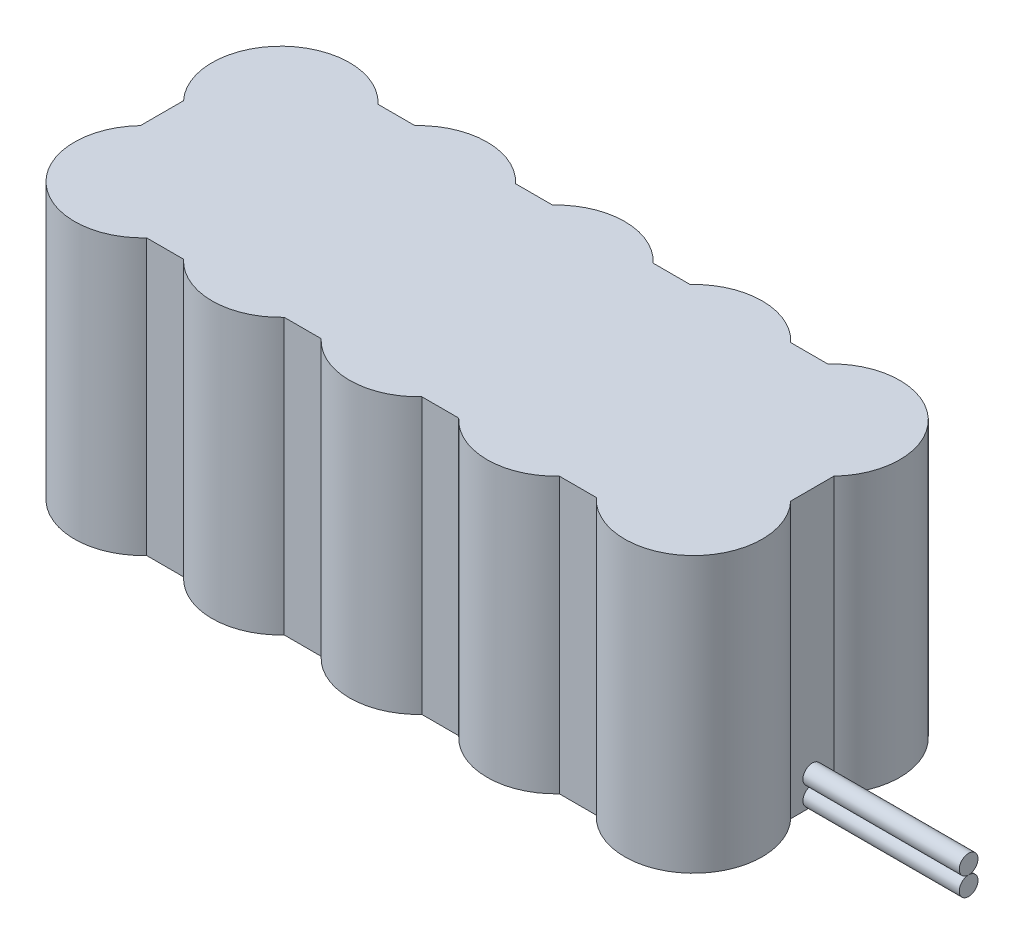
ISO-10303-21;
HEADER;
FILE_DESCRIPTION(('STEP AP214'),'2;1');
FILE_NAME('part.step','',(''),(''),'','','');
FILE_SCHEMA(('AUTOMOTIVE_DESIGN { 1 0 10303 214 1 1 1 1 }'));
ENDSEC;
DATA;
#1=APPLICATION_CONTEXT('core data for automotive mechanical design processes');
#2=APPLICATION_PROTOCOL_DEFINITION('international standard','automotive_design',2000,#1);
#3=PRODUCT_CONTEXT('',#1,'mechanical');
#4=PRODUCT('Part','Part','',(#3));
#5=PRODUCT_RELATED_PRODUCT_CATEGORY('part','',(#4));
#6=PRODUCT_DEFINITION_FORMATION('','',#4);
#7=PRODUCT_DEFINITION_CONTEXT('part definition',#1,'design');
#8=PRODUCT_DEFINITION('design','',#6,#7);
#9=PRODUCT_DEFINITION_SHAPE('','',#8);
#10=(LENGTH_UNIT() NAMED_UNIT(*) SI_UNIT(.MILLI.,.METRE.));
#11=(NAMED_UNIT(*) PLANE_ANGLE_UNIT() SI_UNIT($,.RADIAN.));
#12=(NAMED_UNIT(*) SI_UNIT($,.STERADIAN.) SOLID_ANGLE_UNIT());
#13=UNCERTAINTY_MEASURE_WITH_UNIT(LENGTH_MEASURE(1.E-05),#10,'distance_accuracy_value','');
#14=(GEOMETRIC_REPRESENTATION_CONTEXT(3) GLOBAL_UNCERTAINTY_ASSIGNED_CONTEXT((#13)) GLOBAL_UNIT_ASSIGNED_CONTEXT((#10,
#11,#12)) REPRESENTATION_CONTEXT('',''));
#15=CARTESIAN_POINT('',(0.,0.,0.));
#16=DIRECTION('',(0.,0.,1.));
#17=DIRECTION('',(1.,0.,0.));
#18=AXIS2_PLACEMENT_3D('',#15,#16,#17);
#19=CARTESIAN_POINT('',(121.,0.,0.));
#20=DIRECTION('',(1.,0.,0.));
#21=DIRECTION('',(0.,0.,-1.));
#22=AXIS2_PLACEMENT_3D('',#19,#20,#21);
#23=PLANE('',#22);
#24=CARTESIAN_POINT('',(121.,1.5,0.));
#25=DIRECTION('',(1.,0.,0.));
#26=DIRECTION('',(0.,0.,-1.));
#27=AXIS2_PLACEMENT_3D('',#24,#25,#26);
#28=CIRCLE('',#27,1.5);
#29=CARTESIAN_POINT('',(121.,1.5,-1.5));
#30=VERTEX_POINT('',#29);
#31=EDGE_CURVE('E19',#30,#30,#28,.T.);
#32=ORIENTED_EDGE('',*,*,#31,.T.);
#33=EDGE_LOOP('',(#32));
#34=FACE_BOUND('',#33,.T.);
#35=ADVANCED_FACE('F16',(#34),#23,.T.);
#36=CARTESIAN_POINT('',(96.,1.5,0.));
#37=DIRECTION('',(1.,0.,0.));
#38=DIRECTION('',(0.,0.,-1.));
#39=AXIS2_PLACEMENT_3D('',#36,#37,#38);
#40=CYLINDRICAL_SURFACE('',#39,1.5);
#41=ORIENTED_EDGE('',*,*,#31,.F.);
#42=EDGE_LOOP('',(#41));
#43=FACE_BOUND('',#42,.T.);
#44=CARTESIAN_POINT('',(96.,1.5,0.));
#45=DIRECTION('',(1.,0.,0.));
#46=DIRECTION('',(0.,0.,-1.));
#47=AXIS2_PLACEMENT_3D('',#44,#45,#46);
#48=CIRCLE('',#47,1.5);
#49=CARTESIAN_POINT('',(96.,0.,0.));
#50=VERTEX_POINT('',#49);
#51=CARTESIAN_POINT('',(96.,3.,0.));
#52=VERTEX_POINT('',#51);
#53=EDGE_CURVE('E244',#50,#52,#48,.T.);
#54=ORIENTED_EDGE('',*,*,#53,.T.);
#55=CARTESIAN_POINT('',(96.,1.5,0.));
#56=DIRECTION('',(1.,0.,0.));
#57=DIRECTION('',(0.,0.,-1.));
#58=AXIS2_PLACEMENT_3D('',#55,#56,#57);
#59=CIRCLE('',#58,1.5);
#60=EDGE_CURVE('E46',#52,#50,#59,.T.);
#61=ORIENTED_EDGE('',*,*,#60,.T.);
#62=EDGE_LOOP('',(#54,#61));
#63=FACE_BOUND('',#62,.T.);
#64=ADVANCED_FACE('F424',(#43,#63),#40,.T.);
#65=CARTESIAN_POINT('',(121.,0.,0.));
#66=DIRECTION('',(1.,0.,0.));
#67=DIRECTION('',(0.,0.,-1.));
#68=AXIS2_PLACEMENT_3D('',#65,#66,#67);
#69=PLANE('',#68);
#70=CARTESIAN_POINT('',(121.,4.5,0.));
#71=DIRECTION('',(1.,0.,0.));
#72=DIRECTION('',(0.,0.,-1.));
#73=AXIS2_PLACEMENT_3D('',#70,#71,#72);
#74=CIRCLE('',#73,1.5);
#75=CARTESIAN_POINT('',(121.,4.5,-1.5));
#76=VERTEX_POINT('',#75);
#77=EDGE_CURVE('E24',#76,#76,#74,.T.);
#78=ORIENTED_EDGE('',*,*,#77,.T.);
#79=EDGE_LOOP('',(#78));
#80=FACE_BOUND('',#79,.T.);
#81=ADVANCED_FACE('F416',(#80),#69,.T.);
#82=CARTESIAN_POINT('',(96.,0.,18.5));
#83=DIRECTION('',(1.,0.,0.));
#84=DIRECTION('',(0.,0.,-1.));
#85=AXIS2_PLACEMENT_3D('',#82,#83,#84);
#86=PLANE('',#85);
#87=DIRECTION('',(0.,0.,-1.));
#88=VECTOR('',#87,1.);
#89=CARTESIAN_POINT('',(96.,0.,0.));
#90=LINE('',#89,#88);
#91=CARTESIAN_POINT('',(96.,0.,-3.45016556472926));
#92=VERTEX_POINT('',#91);
#93=EDGE_CURVE('E237',#50,#92,#90,.T.);
#94=ORIENTED_EDGE('',*,*,#93,.T.);
#95=DIRECTION('',(0.,1.,0.));
#96=VECTOR('',#95,1.);
#97=CARTESIAN_POINT('',(96.,22.,-3.45016556472926));
#98=LINE('',#97,#96);
#99=CARTESIAN_POINT('',(96.,43.9999998333333,-3.45016556472926));
#100=VERTEX_POINT('',#99);
#101=EDGE_CURVE('E240',#92,#100,#98,.T.);
#102=ORIENTED_EDGE('',*,*,#101,.T.);
#103=DIRECTION('',(0.,0.,1.));
#104=VECTOR('',#103,1.);
#105=CARTESIAN_POINT('',(96.,44.,0.));
#106=LINE('',#105,#104);
#107=CARTESIAN_POINT('',(96.,43.9999998333333,3.45016556472925));
#108=VERTEX_POINT('',#107);
#109=EDGE_CURVE('E412',#100,#108,#106,.T.);
#110=ORIENTED_EDGE('',*,*,#109,.T.);
#111=DIRECTION('',(0.,1.,0.));
#112=VECTOR('',#111,1.);
#113=CARTESIAN_POINT('',(96.,22.,3.45016556472925));
#114=LINE('',#113,#112);
#115=CARTESIAN_POINT('',(96.,0.,3.45016556472925));
#116=VERTEX_POINT('',#115);
#117=EDGE_CURVE('E58',#116,#108,#114,.T.);
#118=ORIENTED_EDGE('',*,*,#117,.F.);
#119=DIRECTION('',(0.,0.,-1.));
#120=VECTOR('',#119,1.);
#121=CARTESIAN_POINT('',(96.,0.,0.));
#122=LINE('',#121,#120);
#123=EDGE_CURVE('E241',#116,#50,#122,.T.);
#124=ORIENTED_EDGE('',*,*,#123,.T.);
#125=ORIENTED_EDGE('',*,*,#60,.F.);
#126=CARTESIAN_POINT('',(96.,4.5,0.));
#127=DIRECTION('',(1.,0.,0.));
#128=DIRECTION('',(0.,0.,-1.));
#129=AXIS2_PLACEMENT_3D('',#126,#127,#128);
#130=CIRCLE('',#129,1.5);
#131=EDGE_CURVE('E10',#52,#52,#130,.T.);
#132=ORIENTED_EDGE('',*,*,#131,.F.);
#133=ORIENTED_EDGE('',*,*,#53,.F.);
#134=EDGE_LOOP('',(#94,#102,#110,#118,#124,#125,#132,#133));
#135=FACE_BOUND('',#134,.T.);
#136=ADVANCED_FACE('F414',(#135),#86,.T.);
#137=CARTESIAN_POINT('',(0.,0.,0.));
#138=DIRECTION('',(0.,1.,0.));
#139=DIRECTION('',(0.,0.,1.));
#140=AXIS2_PLACEMENT_3D('',#137,#138,#139);
#141=PLANE('',#140);
#142=CARTESIAN_POINT('',(88.,0.,11.));
#143=DIRECTION('',(0.,1.,0.));
#144=DIRECTION('',(0.,0.,1.));
#145=AXIS2_PLACEMENT_3D('',#142,#143,#144);
#146=CIRCLE('',#145,11.);
#147=CARTESIAN_POINT('',(79.9532615302845,0.,18.5));
#148=VERTEX_POINT('',#147);
#149=EDGE_CURVE('E245',#148,#116,#146,.T.);
#150=ORIENTED_EDGE('',*,*,#149,.F.);
#151=DIRECTION('',(1.,0.,0.));
#152=VECTOR('',#151,1.);
#153=CARTESIAN_POINT('',(-8.,0.,18.5));
#154=LINE('',#153,#152);
#155=CARTESIAN_POINT('',(74.0467384697155,0.,18.5));
#156=VERTEX_POINT('',#155);
#157=EDGE_CURVE('E187',#156,#148,#154,.T.);
#158=ORIENTED_EDGE('',*,*,#157,.F.);
#159=CARTESIAN_POINT('',(66.,0.,11.));
#160=DIRECTION('',(0.,1.,0.));
#161=DIRECTION('',(0.,0.,1.));
#162=AXIS2_PLACEMENT_3D('',#159,#160,#161);
#163=CIRCLE('',#162,11.);
#164=CARTESIAN_POINT('',(57.9532615302845,0.,18.5));
#165=VERTEX_POINT('',#164);
#166=EDGE_CURVE('E249',#165,#156,#163,.T.);
#167=ORIENTED_EDGE('',*,*,#166,.F.);
#168=DIRECTION('',(1.,0.,0.));
#169=VECTOR('',#168,1.);
#170=CARTESIAN_POINT('',(-8.,0.,18.5));
#171=LINE('',#170,#169);
#172=CARTESIAN_POINT('',(52.0467384697155,0.,18.5));
#173=VERTEX_POINT('',#172);
#174=EDGE_CURVE('E256',#173,#165,#171,.T.);
#175=ORIENTED_EDGE('',*,*,#174,.F.);
#176=CARTESIAN_POINT('',(44.,0.,11.));
#177=DIRECTION('',(0.,1.,0.));
#178=DIRECTION('',(0.,0.,1.));
#179=AXIS2_PLACEMENT_3D('',#176,#177,#178);
#180=CIRCLE('',#179,11.);
#181=CARTESIAN_POINT('',(35.9532615302845,0.,18.5));
#182=VERTEX_POINT('',#181);
#183=EDGE_CURVE('E259',#182,#173,#180,.T.);
#184=ORIENTED_EDGE('',*,*,#183,.F.);
#185=DIRECTION('',(1.,0.,0.));
#186=VECTOR('',#185,1.);
#187=CARTESIAN_POINT('',(-8.,0.,18.5));
#188=LINE('',#187,#186);
#189=CARTESIAN_POINT('',(30.0467384697155,0.,18.5));
#190=VERTEX_POINT('',#189);
#191=EDGE_CURVE('E262',#190,#182,#188,.T.);
#192=ORIENTED_EDGE('',*,*,#191,.F.);
#193=CARTESIAN_POINT('',(22.,0.,11.));
#194=DIRECTION('',(0.,1.,0.));
#195=DIRECTION('',(0.,0.,1.));
#196=AXIS2_PLACEMENT_3D('',#193,#194,#195);
#197=CIRCLE('',#196,11.);
#198=CARTESIAN_POINT('',(13.9532615302845,0.,18.5));
#199=VERTEX_POINT('',#198);
#200=EDGE_CURVE('E265',#199,#190,#197,.T.);
#201=ORIENTED_EDGE('',*,*,#200,.F.);
#202=DIRECTION('',(1.,0.,0.));
#203=VECTOR('',#202,1.);
#204=CARTESIAN_POINT('',(-8.,0.,18.5));
#205=LINE('',#204,#203);
#206=CARTESIAN_POINT('',(8.04673846971554,0.,18.5));
#207=VERTEX_POINT('',#206);
#208=EDGE_CURVE('E268',#207,#199,#205,.T.);
#209=ORIENTED_EDGE('',*,*,#208,.F.);
#210=CARTESIAN_POINT('',(0.,0.,11.));
#211=DIRECTION('',(0.,1.,0.));
#212=DIRECTION('',(0.,0.,1.));
#213=AXIS2_PLACEMENT_3D('',#210,#211,#212);
#214=CIRCLE('',#213,11.);
#215=CARTESIAN_POINT('',(-8.,0.,3.45016556472925));
#216=VERTEX_POINT('',#215);
#217=EDGE_CURVE('E271',#216,#207,#214,.T.);
#218=ORIENTED_EDGE('',*,*,#217,.F.);
#219=DIRECTION('',(0.,0.,1.));
#220=VECTOR('',#219,1.);
#221=CARTESIAN_POINT('',(-8.,0.,-18.5));
#222=LINE('',#221,#220);
#223=CARTESIAN_POINT('',(-8.,0.,-3.45016556472925));
#224=VERTEX_POINT('',#223);
#225=EDGE_CURVE('E274',#224,#216,#222,.T.);
#226=ORIENTED_EDGE('',*,*,#225,.F.);
#227=CARTESIAN_POINT('',(0.,0.,-11.));
#228=DIRECTION('',(0.,1.,0.));
#229=DIRECTION('',(0.,0.,1.));
#230=AXIS2_PLACEMENT_3D('',#227,#228,#229);
#231=CIRCLE('',#230,11.);
#232=CARTESIAN_POINT('',(8.04673846971554,0.,-18.5));
#233=VERTEX_POINT('',#232);
#234=EDGE_CURVE('E277',#233,#224,#231,.T.);
#235=ORIENTED_EDGE('',*,*,#234,.F.);
#236=DIRECTION('',(-1.,0.,0.));
#237=VECTOR('',#236,1.);
#238=CARTESIAN_POINT('',(96.,0.,-18.5));
#239=LINE('',#238,#237);
#240=CARTESIAN_POINT('',(13.9532615302845,0.,-18.5));
#241=VERTEX_POINT('',#240);
#242=EDGE_CURVE('E280',#241,#233,#239,.T.);
#243=ORIENTED_EDGE('',*,*,#242,.F.);
#244=CARTESIAN_POINT('',(22.,0.,-11.));
#245=DIRECTION('',(0.,1.,0.));
#246=DIRECTION('',(0.,0.,1.));
#247=AXIS2_PLACEMENT_3D('',#244,#245,#246);
#248=CIRCLE('',#247,11.);
#249=CARTESIAN_POINT('',(30.0467384697155,0.,-18.5));
#250=VERTEX_POINT('',#249);
#251=EDGE_CURVE('E283',#250,#241,#248,.T.);
#252=ORIENTED_EDGE('',*,*,#251,.F.);
#253=DIRECTION('',(-1.,0.,0.));
#254=VECTOR('',#253,1.);
#255=CARTESIAN_POINT('',(96.,0.,-18.5));
#256=LINE('',#255,#254);
#257=CARTESIAN_POINT('',(35.9532615302845,0.,-18.5));
#258=VERTEX_POINT('',#257);
#259=EDGE_CURVE('E286',#258,#250,#256,.T.);
#260=ORIENTED_EDGE('',*,*,#259,.F.);
#261=CARTESIAN_POINT('',(44.,0.,-11.));
#262=DIRECTION('',(0.,1.,0.));
#263=DIRECTION('',(0.,0.,1.));
#264=AXIS2_PLACEMENT_3D('',#261,#262,#263);
#265=CIRCLE('',#264,11.);
#266=CARTESIAN_POINT('',(52.0467384697155,0.,-18.5));
#267=VERTEX_POINT('',#266);
#268=EDGE_CURVE('E289',#267,#258,#265,.T.);
#269=ORIENTED_EDGE('',*,*,#268,.F.);
#270=DIRECTION('',(-1.,0.,0.));
#271=VECTOR('',#270,1.);
#272=CARTESIAN_POINT('',(96.,0.,-18.5));
#273=LINE('',#272,#271);
#274=CARTESIAN_POINT('',(57.9532615302845,0.,-18.5));
#275=VERTEX_POINT('',#274);
#276=EDGE_CURVE('E292',#275,#267,#273,.T.);
#277=ORIENTED_EDGE('',*,*,#276,.F.);
#278=CARTESIAN_POINT('',(66.,0.,-11.));
#279=DIRECTION('',(0.,1.,0.));
#280=DIRECTION('',(0.,0.,1.));
#281=AXIS2_PLACEMENT_3D('',#278,#279,#280);
#282=CIRCLE('',#281,11.);
#283=CARTESIAN_POINT('',(74.0467384697155,0.,-18.5));
#284=VERTEX_POINT('',#283);
#285=EDGE_CURVE('E295',#284,#275,#282,.T.);
#286=ORIENTED_EDGE('',*,*,#285,.F.);
#287=DIRECTION('',(-1.,0.,0.));
#288=VECTOR('',#287,1.);
#289=CARTESIAN_POINT('',(96.,0.,-18.5));
#290=LINE('',#289,#288);
#291=CARTESIAN_POINT('',(79.9532615302845,0.,-18.5));
#292=VERTEX_POINT('',#291);
#293=EDGE_CURVE('E298',#292,#284,#290,.T.);
#294=ORIENTED_EDGE('',*,*,#293,.F.);
#295=CARTESIAN_POINT('',(88.,0.,-11.));
#296=DIRECTION('',(0.,1.,0.));
#297=DIRECTION('',(0.,0.,1.));
#298=AXIS2_PLACEMENT_3D('',#295,#296,#297);
#299=CIRCLE('',#298,11.);
#300=EDGE_CURVE('E301',#92,#292,#299,.T.);
#301=ORIENTED_EDGE('',*,*,#300,.F.);
#302=ORIENTED_EDGE('',*,*,#93,.F.);
#303=ORIENTED_EDGE('',*,*,#123,.F.);
#304=EDGE_LOOP('',(#150,#158,#167,#175,#184,#192,#201,#209,#218,#226,#235,#243,#252,#260,#269,
#277,#286,#294,#301,#302,#303));
#305=FACE_BOUND('',#304,.T.);
#306=ADVANCED_FACE('F348',(#305),#141,.F.);
#307=CARTESIAN_POINT('',(88.,0.,-11.));
#308=DIRECTION('',(0.,1.,0.));
#309=DIRECTION('',(0.,0.,1.));
#310=AXIS2_PLACEMENT_3D('',#307,#308,#309);
#311=CYLINDRICAL_SURFACE('',#310,11.);
#312=CARTESIAN_POINT('',(88.,44.,-11.));
#313=DIRECTION('',(0.,1.,0.));
#314=DIRECTION('',(0.,0.,1.));
#315=AXIS2_PLACEMENT_3D('',#312,#313,#314);
#316=CIRCLE('',#315,11.);
#317=CARTESIAN_POINT('',(79.9532615302845,44.,-18.5));
#318=VERTEX_POINT('',#317);
#319=EDGE_CURVE('E304',#100,#318,#316,.T.);
#320=ORIENTED_EDGE('',*,*,#319,.F.);
#321=ORIENTED_EDGE('',*,*,#101,.F.);
#322=ORIENTED_EDGE('',*,*,#300,.T.);
#323=DIRECTION('',(0.,1.,0.));
#324=VECTOR('',#323,1.);
#325=CARTESIAN_POINT('',(79.9532615302845,0.,-18.5));
#326=LINE('',#325,#324);
#327=EDGE_CURVE('E306',#292,#318,#326,.T.);
#328=ORIENTED_EDGE('',*,*,#327,.T.);
#329=EDGE_LOOP('',(#320,#321,#322,#328));
#330=FACE_BOUND('',#329,.T.);
#331=ADVANCED_FACE('F409',(#330),#311,.T.);
#332=CARTESIAN_POINT('',(0.,44.,0.));
#333=DIRECTION('',(0.,1.,0.));
#334=DIRECTION('',(0.,0.,1.));
#335=AXIS2_PLACEMENT_3D('',#332,#333,#334);
#336=PLANE('',#335);
#337=ORIENTED_EDGE('',*,*,#109,.F.);
#338=ORIENTED_EDGE('',*,*,#319,.T.);
#339=DIRECTION('',(1.,0.,0.));
#340=VECTOR('',#339,1.);
#341=CARTESIAN_POINT('',(0.,44.,-18.5));
#342=LINE('',#341,#340);
#343=CARTESIAN_POINT('',(74.0467384697155,44.,-18.5));
#344=VERTEX_POINT('',#343);
#345=EDGE_CURVE('E309',#318,#344,#342,.F.);
#346=ORIENTED_EDGE('',*,*,#345,.T.);
#347=CARTESIAN_POINT('',(66.,44.,-11.));
#348=DIRECTION('',(0.,1.,0.));
#349=DIRECTION('',(0.,0.,1.));
#350=AXIS2_PLACEMENT_3D('',#347,#348,#349);
#351=CIRCLE('',#350,11.);
#352=CARTESIAN_POINT('',(57.9532615302845,44.,-18.5));
#353=VERTEX_POINT('',#352);
#354=EDGE_CURVE('E311',#344,#353,#351,.T.);
#355=ORIENTED_EDGE('',*,*,#354,.T.);
#356=DIRECTION('',(1.,0.,0.));
#357=VECTOR('',#356,1.);
#358=CARTESIAN_POINT('',(0.,44.,-18.5));
#359=LINE('',#358,#357);
#360=CARTESIAN_POINT('',(52.0467384697155,44.,-18.5));
#361=VERTEX_POINT('',#360);
#362=EDGE_CURVE('E313',#353,#361,#359,.F.);
#363=ORIENTED_EDGE('',*,*,#362,.T.);
#364=CARTESIAN_POINT('',(44.,44.,-11.));
#365=DIRECTION('',(0.,1.,0.));
#366=DIRECTION('',(0.,0.,1.));
#367=AXIS2_PLACEMENT_3D('',#364,#365,#366);
#368=CIRCLE('',#367,11.);
#369=CARTESIAN_POINT('',(35.9532615302845,44.,-18.5));
#370=VERTEX_POINT('',#369);
#371=EDGE_CURVE('E315',#361,#370,#368,.T.);
#372=ORIENTED_EDGE('',*,*,#371,.T.);
#373=DIRECTION('',(1.,0.,0.));
#374=VECTOR('',#373,1.);
#375=CARTESIAN_POINT('',(0.,44.,-18.5));
#376=LINE('',#375,#374);
#377=CARTESIAN_POINT('',(30.0467384697155,44.,-18.5));
#378=VERTEX_POINT('',#377);
#379=EDGE_CURVE('E317',#370,#378,#376,.F.);
#380=ORIENTED_EDGE('',*,*,#379,.T.);
#381=CARTESIAN_POINT('',(22.,44.,-11.));
#382=DIRECTION('',(0.,1.,0.));
#383=DIRECTION('',(0.,0.,1.));
#384=AXIS2_PLACEMENT_3D('',#381,#382,#383);
#385=CIRCLE('',#384,11.);
#386=CARTESIAN_POINT('',(13.9532615302845,44.,-18.5));
#387=VERTEX_POINT('',#386);
#388=EDGE_CURVE('E319',#378,#387,#385,.T.);
#389=ORIENTED_EDGE('',*,*,#388,.T.);
#390=DIRECTION('',(1.,0.,0.));
#391=VECTOR('',#390,1.);
#392=CARTESIAN_POINT('',(0.,44.,-18.5));
#393=LINE('',#392,#391);
#394=CARTESIAN_POINT('',(8.04673846971554,44.,-18.5));
#395=VERTEX_POINT('',#394);
#396=EDGE_CURVE('E321',#387,#395,#393,.F.);
#397=ORIENTED_EDGE('',*,*,#396,.T.);
#398=CARTESIAN_POINT('',(0.,44.,-11.));
#399=DIRECTION('',(0.,1.,0.));
#400=DIRECTION('',(0.,0.,1.));
#401=AXIS2_PLACEMENT_3D('',#398,#399,#400);
#402=CIRCLE('',#401,11.);
#403=CARTESIAN_POINT('',(-8.,44.,-3.45016556472925));
#404=VERTEX_POINT('',#403);
#405=EDGE_CURVE('E323',#395,#404,#402,.T.);
#406=ORIENTED_EDGE('',*,*,#405,.T.);
#407=DIRECTION('',(0.,0.,1.));
#408=VECTOR('',#407,1.);
#409=CARTESIAN_POINT('',(-8.,44.,0.));
#410=LINE('',#409,#408);
#411=CARTESIAN_POINT('',(-8.,44.,3.45016556472925));
#412=VERTEX_POINT('',#411);
#413=EDGE_CURVE('E325',#404,#412,#410,.T.);
#414=ORIENTED_EDGE('',*,*,#413,.T.);
#415=CARTESIAN_POINT('',(0.,44.,11.));
#416=DIRECTION('',(0.,1.,0.));
#417=DIRECTION('',(0.,0.,1.));
#418=AXIS2_PLACEMENT_3D('',#415,#416,#417);
#419=CIRCLE('',#418,11.);
#420=CARTESIAN_POINT('',(8.04673846971554,44.,18.5));
#421=VERTEX_POINT('',#420);
#422=EDGE_CURVE('E327',#412,#421,#419,.T.);
#423=ORIENTED_EDGE('',*,*,#422,.T.);
#424=DIRECTION('',(1.,0.,0.));
#425=VECTOR('',#424,1.);
#426=CARTESIAN_POINT('',(0.,44.,18.5));
#427=LINE('',#426,#425);
#428=CARTESIAN_POINT('',(13.9532615302845,44.,18.5));
#429=VERTEX_POINT('',#428);
#430=EDGE_CURVE('E329',#421,#429,#427,.T.);
#431=ORIENTED_EDGE('',*,*,#430,.T.);
#432=CARTESIAN_POINT('',(22.,44.,11.));
#433=DIRECTION('',(0.,1.,0.));
#434=DIRECTION('',(0.,0.,1.));
#435=AXIS2_PLACEMENT_3D('',#432,#433,#434);
#436=CIRCLE('',#435,11.);
#437=CARTESIAN_POINT('',(30.0467384697155,44.,18.5));
#438=VERTEX_POINT('',#437);
#439=EDGE_CURVE('E331',#429,#438,#436,.T.);
#440=ORIENTED_EDGE('',*,*,#439,.T.);
#441=DIRECTION('',(1.,0.,0.));
#442=VECTOR('',#441,1.);
#443=CARTESIAN_POINT('',(0.,44.,18.5));
#444=LINE('',#443,#442);
#445=CARTESIAN_POINT('',(35.9532615302845,44.,18.5));
#446=VERTEX_POINT('',#445);
#447=EDGE_CURVE('E333',#438,#446,#444,.T.);
#448=ORIENTED_EDGE('',*,*,#447,.T.);
#449=CARTESIAN_POINT('',(44.,44.,11.));
#450=DIRECTION('',(0.,1.,0.));
#451=DIRECTION('',(0.,0.,1.));
#452=AXIS2_PLACEMENT_3D('',#449,#450,#451);
#453=CIRCLE('',#452,11.);
#454=CARTESIAN_POINT('',(52.0467384697155,44.,18.5));
#455=VERTEX_POINT('',#454);
#456=EDGE_CURVE('E335',#446,#455,#453,.T.);
#457=ORIENTED_EDGE('',*,*,#456,.T.);
#458=DIRECTION('',(1.,0.,0.));
#459=VECTOR('',#458,1.);
#460=CARTESIAN_POINT('',(0.,44.,18.5));
#461=LINE('',#460,#459);
#462=CARTESIAN_POINT('',(57.9532615302845,44.,18.5));
#463=VERTEX_POINT('',#462);
#464=EDGE_CURVE('E337',#455,#463,#461,.T.);
#465=ORIENTED_EDGE('',*,*,#464,.T.);
#466=CARTESIAN_POINT('',(66.,44.,11.));
#467=DIRECTION('',(0.,1.,0.));
#468=DIRECTION('',(0.,0.,1.));
#469=AXIS2_PLACEMENT_3D('',#466,#467,#468);
#470=CIRCLE('',#469,11.);
#471=CARTESIAN_POINT('',(74.0467384697155,44.,18.5));
#472=VERTEX_POINT('',#471);
#473=EDGE_CURVE('E166',#463,#472,#470,.T.);
#474=ORIENTED_EDGE('',*,*,#473,.T.);
#475=DIRECTION('',(1.,0.,0.));
#476=VECTOR('',#475,1.);
#477=CARTESIAN_POINT('',(0.,44.,18.5));
#478=LINE('',#477,#476);
#479=CARTESIAN_POINT('',(79.9532615302845,44.,18.5));
#480=VERTEX_POINT('',#479);
#481=EDGE_CURVE('E169',#472,#480,#478,.T.);
#482=ORIENTED_EDGE('',*,*,#481,.T.);
#483=CARTESIAN_POINT('',(88.,44.,11.));
#484=DIRECTION('',(0.,1.,0.));
#485=DIRECTION('',(0.,0.,1.));
#486=AXIS2_PLACEMENT_3D('',#483,#484,#485);
#487=CIRCLE('',#486,11.);
#488=EDGE_CURVE('E173',#480,#108,#487,.T.);
#489=ORIENTED_EDGE('',*,*,#488,.T.);
#490=EDGE_LOOP('',(#337,#338,#346,#355,#363,#372,#380,#389,#397,#406,#414,#423,#431,#440,#448,
#457,#465,#474,#482,#489));
#491=FACE_BOUND('',#490,.T.);
#492=ADVANCED_FACE('F172',(#491),#336,.T.);
#493=CARTESIAN_POINT('',(88.,0.,11.));
#494=DIRECTION('',(0.,1.,0.));
#495=DIRECTION('',(0.,0.,1.));
#496=AXIS2_PLACEMENT_3D('',#493,#494,#495);
#497=CYLINDRICAL_SURFACE('',#496,11.);
#498=ORIENTED_EDGE('',*,*,#488,.F.);
#499=DIRECTION('',(0.,1.,0.));
#500=VECTOR('',#499,1.);
#501=CARTESIAN_POINT('',(79.9532615302845,0.,18.5));
#502=LINE('',#501,#500);
#503=EDGE_CURVE('E183',#480,#148,#502,.F.);
#504=ORIENTED_EDGE('',*,*,#503,.T.);
#505=ORIENTED_EDGE('',*,*,#149,.T.);
#506=ORIENTED_EDGE('',*,*,#117,.T.);
#507=EDGE_LOOP('',(#498,#504,#505,#506));
#508=FACE_BOUND('',#507,.T.);
#509=ADVANCED_FACE('F181',(#508),#497,.T.);
#510=CARTESIAN_POINT('',(-8.,0.,18.5));
#511=DIRECTION('',(0.,0.,1.));
#512=DIRECTION('',(1.,0.,0.));
#513=AXIS2_PLACEMENT_3D('',#510,#511,#512);
#514=PLANE('',#513);
#515=DIRECTION('',(0.,1.,0.));
#516=VECTOR('',#515,1.);
#517=CARTESIAN_POINT('',(74.0467384697155,0.,18.5));
#518=LINE('',#517,#516);
#519=EDGE_CURVE('E188',#472,#156,#518,.F.);
#520=ORIENTED_EDGE('',*,*,#519,.T.);
#521=ORIENTED_EDGE('',*,*,#157,.T.);
#522=ORIENTED_EDGE('',*,*,#503,.F.);
#523=ORIENTED_EDGE('',*,*,#481,.F.);
#524=EDGE_LOOP('',(#520,#521,#522,#523));
#525=FACE_BOUND('',#524,.T.);
#526=ADVANCED_FACE('F186',(#525),#514,.T.);
#527=CARTESIAN_POINT('',(66.,0.,11.));
#528=DIRECTION('',(0.,1.,0.));
#529=DIRECTION('',(0.,0.,1.));
#530=AXIS2_PLACEMENT_3D('',#527,#528,#529);
#531=CYLINDRICAL_SURFACE('',#530,11.);
#532=ORIENTED_EDGE('',*,*,#519,.F.);
#533=ORIENTED_EDGE('',*,*,#473,.F.);
#534=DIRECTION('',(0.,1.,0.));
#535=VECTOR('',#534,1.);
#536=CARTESIAN_POINT('',(57.9532615302845,0.,18.5));
#537=LINE('',#536,#535);
#538=EDGE_CURVE('E190',#463,#165,#537,.F.);
#539=ORIENTED_EDGE('',*,*,#538,.T.);
#540=ORIENTED_EDGE('',*,*,#166,.T.);
#541=EDGE_LOOP('',(#532,#533,#539,#540));
#542=FACE_BOUND('',#541,.T.);
#543=ADVANCED_FACE('F345',(#542),#531,.T.);
#544=CARTESIAN_POINT('',(-8.,0.,18.5));
#545=DIRECTION('',(0.,0.,1.));
#546=DIRECTION('',(1.,0.,0.));
#547=AXIS2_PLACEMENT_3D('',#544,#545,#546);
#548=PLANE('',#547);
#549=DIRECTION('',(0.,1.,0.));
#550=VECTOR('',#549,1.);
#551=CARTESIAN_POINT('',(52.0467384697155,0.,18.5));
#552=LINE('',#551,#550);
#553=EDGE_CURVE('E195',#455,#173,#552,.F.);
#554=ORIENTED_EDGE('',*,*,#553,.T.);
#555=ORIENTED_EDGE('',*,*,#174,.T.);
#556=ORIENTED_EDGE('',*,*,#538,.F.);
#557=ORIENTED_EDGE('',*,*,#464,.F.);
#558=EDGE_LOOP('',(#554,#555,#556,#557));
#559=FACE_BOUND('',#558,.T.);
#560=ADVANCED_FACE('F346',(#559),#548,.T.);
#561=CARTESIAN_POINT('',(44.,0.,11.));
#562=DIRECTION('',(0.,1.,0.));
#563=DIRECTION('',(0.,0.,1.));
#564=AXIS2_PLACEMENT_3D('',#561,#562,#563);
#565=CYLINDRICAL_SURFACE('',#564,11.);
#566=ORIENTED_EDGE('',*,*,#553,.F.);
#567=ORIENTED_EDGE('',*,*,#456,.F.);
#568=DIRECTION('',(0.,1.,0.));
#569=VECTOR('',#568,1.);
#570=CARTESIAN_POINT('',(35.9532615302845,0.,18.5));
#571=LINE('',#570,#569);
#572=EDGE_CURVE('E198',#446,#182,#571,.F.);
#573=ORIENTED_EDGE('',*,*,#572,.T.);
#574=ORIENTED_EDGE('',*,*,#183,.T.);
#575=EDGE_LOOP('',(#566,#567,#573,#574));
#576=FACE_BOUND('',#575,.T.);
#577=ADVANCED_FACE('F350',(#576),#565,.T.);
#578=CARTESIAN_POINT('',(-8.,0.,18.5));
#579=DIRECTION('',(0.,0.,1.));
#580=DIRECTION('',(1.,0.,0.));
#581=AXIS2_PLACEMENT_3D('',#578,#579,#580);
#582=PLANE('',#581);
#583=DIRECTION('',(0.,1.,0.));
#584=VECTOR('',#583,1.);
#585=CARTESIAN_POINT('',(30.0467384697155,0.,18.5));
#586=LINE('',#585,#584);
#587=EDGE_CURVE('E201',#438,#190,#586,.F.);
#588=ORIENTED_EDGE('',*,*,#587,.T.);
#589=ORIENTED_EDGE('',*,*,#191,.T.);
#590=ORIENTED_EDGE('',*,*,#572,.F.);
#591=ORIENTED_EDGE('',*,*,#447,.F.);
#592=EDGE_LOOP('',(#588,#589,#590,#591));
#593=FACE_BOUND('',#592,.T.);
#594=ADVANCED_FACE('F354',(#593),#582,.T.);
#595=CARTESIAN_POINT('',(22.,0.,11.));
#596=DIRECTION('',(0.,1.,0.));
#597=DIRECTION('',(0.,0.,1.));
#598=AXIS2_PLACEMENT_3D('',#595,#596,#597);
#599=CYLINDRICAL_SURFACE('',#598,11.);
#600=ORIENTED_EDGE('',*,*,#587,.F.);
#601=ORIENTED_EDGE('',*,*,#439,.F.);
#602=DIRECTION('',(0.,1.,0.));
#603=VECTOR('',#602,1.);
#604=CARTESIAN_POINT('',(13.9532615302845,0.,18.5));
#605=LINE('',#604,#603);
#606=EDGE_CURVE('E204',#429,#199,#605,.F.);
#607=ORIENTED_EDGE('',*,*,#606,.T.);
#608=ORIENTED_EDGE('',*,*,#200,.T.);
#609=EDGE_LOOP('',(#600,#601,#607,#608));
#610=FACE_BOUND('',#609,.T.);
#611=ADVANCED_FACE('F357',(#610),#599,.T.);
#612=CARTESIAN_POINT('',(-8.,0.,18.5));
#613=DIRECTION('',(0.,0.,1.));
#614=DIRECTION('',(1.,0.,0.));
#615=AXIS2_PLACEMENT_3D('',#612,#613,#614);
#616=PLANE('',#615);
#617=DIRECTION('',(0.,1.,0.));
#618=VECTOR('',#617,1.);
#619=CARTESIAN_POINT('',(8.04673846971554,0.,18.5));
#620=LINE('',#619,#618);
#621=EDGE_CURVE('E207',#421,#207,#620,.F.);
#622=ORIENTED_EDGE('',*,*,#621,.T.);
#623=ORIENTED_EDGE('',*,*,#208,.T.);
#624=ORIENTED_EDGE('',*,*,#606,.F.);
#625=ORIENTED_EDGE('',*,*,#430,.F.);
#626=EDGE_LOOP('',(#622,#623,#624,#625));
#627=FACE_BOUND('',#626,.T.);
#628=ADVANCED_FACE('F362',(#627),#616,.T.);
#629=CARTESIAN_POINT('',(0.,0.,11.));
#630=DIRECTION('',(0.,1.,0.));
#631=DIRECTION('',(0.,0.,1.));
#632=AXIS2_PLACEMENT_3D('',#629,#630,#631);
#633=CYLINDRICAL_SURFACE('',#632,11.);
#634=ORIENTED_EDGE('',*,*,#217,.T.);
#635=ORIENTED_EDGE('',*,*,#621,.F.);
#636=ORIENTED_EDGE('',*,*,#422,.F.);
#637=DIRECTION('',(0.,1.,0.));
#638=VECTOR('',#637,1.);
#639=CARTESIAN_POINT('',(-8.,0.,3.45016556472925));
#640=LINE('',#639,#638);
#641=EDGE_CURVE('E210',#412,#216,#640,.F.);
#642=ORIENTED_EDGE('',*,*,#641,.T.);
#643=EDGE_LOOP('',(#634,#635,#636,#642));
#644=FACE_BOUND('',#643,.T.);
#645=ADVANCED_FACE('F365',(#644),#633,.T.);
#646=CARTESIAN_POINT('',(-8.,0.,-18.5));
#647=DIRECTION('',(-1.,0.,0.));
#648=DIRECTION('',(0.,0.,1.));
#649=AXIS2_PLACEMENT_3D('',#646,#647,#648);
#650=PLANE('',#649);
#651=ORIENTED_EDGE('',*,*,#641,.F.);
#652=ORIENTED_EDGE('',*,*,#413,.F.);
#653=DIRECTION('',(0.,1.,0.));
#654=VECTOR('',#653,1.);
#655=CARTESIAN_POINT('',(-8.,0.,-3.45016556472925));
#656=LINE('',#655,#654);
#657=EDGE_CURVE('E213',#404,#224,#656,.F.);
#658=ORIENTED_EDGE('',*,*,#657,.T.);
#659=ORIENTED_EDGE('',*,*,#225,.T.);
#660=EDGE_LOOP('',(#651,#652,#658,#659));
#661=FACE_BOUND('',#660,.T.);
#662=ADVANCED_FACE('F370',(#661),#650,.T.);
#663=CARTESIAN_POINT('',(0.,0.,-11.));
#664=DIRECTION('',(0.,1.,0.));
#665=DIRECTION('',(0.,0.,1.));
#666=AXIS2_PLACEMENT_3D('',#663,#664,#665);
#667=CYLINDRICAL_SURFACE('',#666,11.);
#668=ORIENTED_EDGE('',*,*,#234,.T.);
#669=ORIENTED_EDGE('',*,*,#657,.F.);
#670=ORIENTED_EDGE('',*,*,#405,.F.);
#671=DIRECTION('',(0.,1.,0.));
#672=VECTOR('',#671,1.);
#673=CARTESIAN_POINT('',(8.04673846971554,0.,-18.5));
#674=LINE('',#673,#672);
#675=EDGE_CURVE('E216',#395,#233,#674,.F.);
#676=ORIENTED_EDGE('',*,*,#675,.T.);
#677=EDGE_LOOP('',(#668,#669,#670,#676));
#678=FACE_BOUND('',#677,.T.);
#679=ADVANCED_FACE('F373',(#678),#667,.T.);
#680=CARTESIAN_POINT('',(96.,0.,-18.5));
#681=DIRECTION('',(0.,0.,-1.));
#682=DIRECTION('',(-1.,0.,0.));
#683=AXIS2_PLACEMENT_3D('',#680,#681,#682);
#684=PLANE('',#683);
#685=ORIENTED_EDGE('',*,*,#675,.F.);
#686=ORIENTED_EDGE('',*,*,#396,.F.);
#687=DIRECTION('',(0.,1.,0.));
#688=VECTOR('',#687,1.);
#689=CARTESIAN_POINT('',(13.9532615302845,0.,-18.5));
#690=LINE('',#689,#688);
#691=EDGE_CURVE('E219',#387,#241,#690,.F.);
#692=ORIENTED_EDGE('',*,*,#691,.T.);
#693=ORIENTED_EDGE('',*,*,#242,.T.);
#694=EDGE_LOOP('',(#685,#686,#692,#693));
#695=FACE_BOUND('',#694,.T.);
#696=ADVANCED_FACE('F378',(#695),#684,.T.);
#697=CARTESIAN_POINT('',(22.,0.,-11.));
#698=DIRECTION('',(0.,1.,0.));
#699=DIRECTION('',(0.,0.,1.));
#700=AXIS2_PLACEMENT_3D('',#697,#698,#699);
#701=CYLINDRICAL_SURFACE('',#700,11.);
#702=ORIENTED_EDGE('',*,*,#691,.F.);
#703=ORIENTED_EDGE('',*,*,#388,.F.);
#704=DIRECTION('',(0.,1.,0.));
#705=VECTOR('',#704,1.);
#706=CARTESIAN_POINT('',(30.0467384697155,0.,-18.5));
#707=LINE('',#706,#705);
#708=EDGE_CURVE('E222',#378,#250,#707,.F.);
#709=ORIENTED_EDGE('',*,*,#708,.T.);
#710=ORIENTED_EDGE('',*,*,#251,.T.);
#711=EDGE_LOOP('',(#702,#703,#709,#710));
#712=FACE_BOUND('',#711,.T.);
#713=ADVANCED_FACE('F381',(#712),#701,.T.);
#714=CARTESIAN_POINT('',(96.,0.,-18.5));
#715=DIRECTION('',(0.,0.,-1.));
#716=DIRECTION('',(-1.,0.,0.));
#717=AXIS2_PLACEMENT_3D('',#714,#715,#716);
#718=PLANE('',#717);
#719=ORIENTED_EDGE('',*,*,#708,.F.);
#720=ORIENTED_EDGE('',*,*,#379,.F.);
#721=DIRECTION('',(0.,1.,0.));
#722=VECTOR('',#721,1.);
#723=CARTESIAN_POINT('',(35.9532615302845,0.,-18.5));
#724=LINE('',#723,#722);
#725=EDGE_CURVE('E225',#370,#258,#724,.F.);
#726=ORIENTED_EDGE('',*,*,#725,.T.);
#727=ORIENTED_EDGE('',*,*,#259,.T.);
#728=EDGE_LOOP('',(#719,#720,#726,#727));
#729=FACE_BOUND('',#728,.T.);
#730=ADVANCED_FACE('F386',(#729),#718,.T.);
#731=CARTESIAN_POINT('',(44.,0.,-11.));
#732=DIRECTION('',(0.,1.,0.));
#733=DIRECTION('',(0.,0.,1.));
#734=AXIS2_PLACEMENT_3D('',#731,#732,#733);
#735=CYLINDRICAL_SURFACE('',#734,11.);
#736=ORIENTED_EDGE('',*,*,#725,.F.);
#737=ORIENTED_EDGE('',*,*,#371,.F.);
#738=DIRECTION('',(0.,1.,0.));
#739=VECTOR('',#738,1.);
#740=CARTESIAN_POINT('',(52.0467384697155,0.,-18.5));
#741=LINE('',#740,#739);
#742=EDGE_CURVE('E228',#361,#267,#741,.F.);
#743=ORIENTED_EDGE('',*,*,#742,.T.);
#744=ORIENTED_EDGE('',*,*,#268,.T.);
#745=EDGE_LOOP('',(#736,#737,#743,#744));
#746=FACE_BOUND('',#745,.T.);
#747=ADVANCED_FACE('F389',(#746),#735,.T.);
#748=CARTESIAN_POINT('',(96.,0.,-18.5));
#749=DIRECTION('',(0.,0.,-1.));
#750=DIRECTION('',(-1.,0.,0.));
#751=AXIS2_PLACEMENT_3D('',#748,#749,#750);
#752=PLANE('',#751);
#753=ORIENTED_EDGE('',*,*,#742,.F.);
#754=ORIENTED_EDGE('',*,*,#362,.F.);
#755=DIRECTION('',(0.,1.,0.));
#756=VECTOR('',#755,1.);
#757=CARTESIAN_POINT('',(57.9532615302845,0.,-18.5));
#758=LINE('',#757,#756);
#759=EDGE_CURVE('E231',#353,#275,#758,.F.);
#760=ORIENTED_EDGE('',*,*,#759,.T.);
#761=ORIENTED_EDGE('',*,*,#276,.T.);
#762=EDGE_LOOP('',(#753,#754,#760,#761));
#763=FACE_BOUND('',#762,.T.);
#764=ADVANCED_FACE('F394',(#763),#752,.T.);
#765=CARTESIAN_POINT('',(66.,0.,-11.));
#766=DIRECTION('',(0.,1.,0.));
#767=DIRECTION('',(0.,0.,1.));
#768=AXIS2_PLACEMENT_3D('',#765,#766,#767);
#769=CYLINDRICAL_SURFACE('',#768,11.);
#770=ORIENTED_EDGE('',*,*,#759,.F.);
#771=ORIENTED_EDGE('',*,*,#354,.F.);
#772=DIRECTION('',(0.,1.,0.));
#773=VECTOR('',#772,1.);
#774=CARTESIAN_POINT('',(74.0467384697155,0.,-18.5));
#775=LINE('',#774,#773);
#776=EDGE_CURVE('E234',#344,#284,#775,.F.);
#777=ORIENTED_EDGE('',*,*,#776,.T.);
#778=ORIENTED_EDGE('',*,*,#285,.T.);
#779=EDGE_LOOP('',(#770,#771,#777,#778));
#780=FACE_BOUND('',#779,.T.);
#781=ADVANCED_FACE('F397',(#780),#769,.T.);
#782=CARTESIAN_POINT('',(96.,0.,-18.5));
#783=DIRECTION('',(0.,0.,-1.));
#784=DIRECTION('',(-1.,0.,0.));
#785=AXIS2_PLACEMENT_3D('',#782,#783,#784);
#786=PLANE('',#785);
#787=ORIENTED_EDGE('',*,*,#776,.F.);
#788=ORIENTED_EDGE('',*,*,#345,.F.);
#789=ORIENTED_EDGE('',*,*,#327,.F.);
#790=ORIENTED_EDGE('',*,*,#293,.T.);
#791=EDGE_LOOP('',(#787,#788,#789,#790));
#792=FACE_BOUND('',#791,.T.);
#793=ADVANCED_FACE('F402',(#792),#786,.T.);
#794=CARTESIAN_POINT('',(96.,4.5,0.));
#795=DIRECTION('',(1.,0.,0.));
#796=DIRECTION('',(0.,0.,-1.));
#797=AXIS2_PLACEMENT_3D('',#794,#795,#796);
#798=CYLINDRICAL_SURFACE('',#797,1.5);
#799=ORIENTED_EDGE('',*,*,#77,.F.);
#800=EDGE_LOOP('',(#799));
#801=FACE_BOUND('',#800,.T.);
#802=ORIENTED_EDGE('',*,*,#131,.T.);
#803=EDGE_LOOP('',(#802));
#804=FACE_BOUND('',#803,.T.);
#805=ADVANCED_FACE('F427',(#801,#804),#798,.T.);
#806=CLOSED_SHELL('',(#35,#64,#81,#136,#306,#331,#492,#509,#526,#543,#560,#577,#594,#611,#628,
#645,#662,#679,#696,#713,#730,#747,#764,#781,#793,#805));
#807=MANIFOLD_SOLID_BREP('B1',#806);
#808=ADVANCED_BREP_SHAPE_REPRESENTATION('',(#18,#807),#14);
#809=SHAPE_DEFINITION_REPRESENTATION(#9,#808);
ENDSEC;
END-ISO-10303-21;
